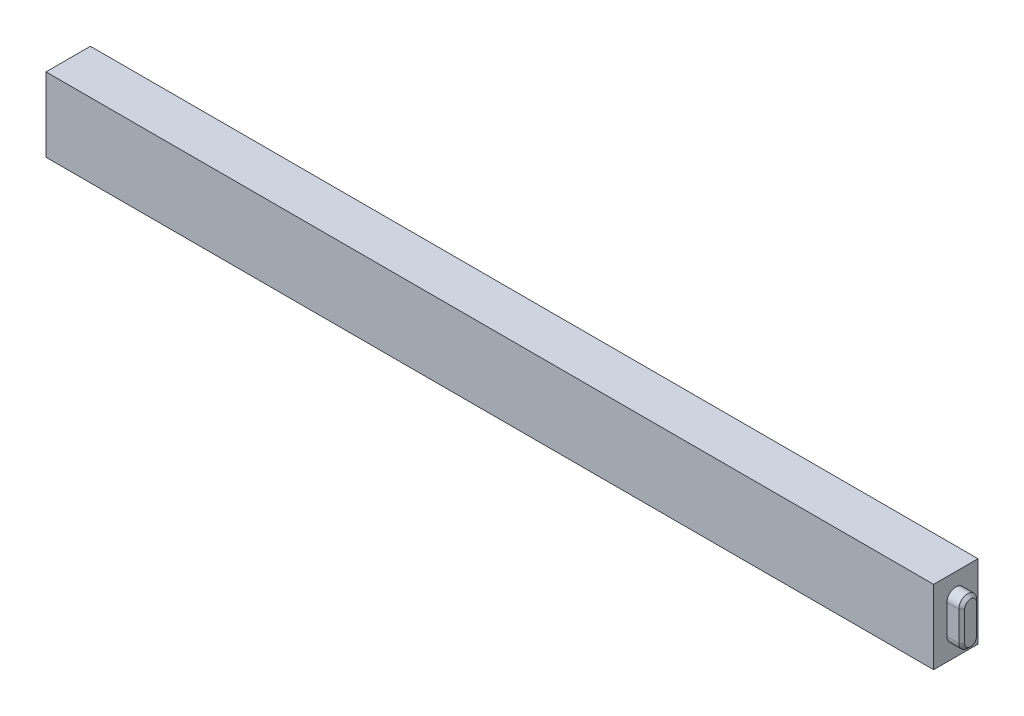
ISO-10303-21;
HEADER;
FILE_DESCRIPTION(('STEP AP214'),'2;1');
FILE_NAME('part.step','',(''),(''),'','','');
FILE_SCHEMA(('AUTOMOTIVE_DESIGN { 1 0 10303 214 1 1 1 1 }'));
ENDSEC;
DATA;
#1=APPLICATION_CONTEXT('core data for automotive mechanical design processes');
#2=APPLICATION_PROTOCOL_DEFINITION('international standard','automotive_design',2000,#1);
#3=PRODUCT_CONTEXT('',#1,'mechanical');
#4=PRODUCT('Part','Part','',(#3));
#5=PRODUCT_RELATED_PRODUCT_CATEGORY('part','',(#4));
#6=PRODUCT_DEFINITION_FORMATION('','',#4);
#7=PRODUCT_DEFINITION_CONTEXT('part definition',#1,'design');
#8=PRODUCT_DEFINITION('design','',#6,#7);
#9=PRODUCT_DEFINITION_SHAPE('','',#8);
#10=(LENGTH_UNIT() NAMED_UNIT(*) SI_UNIT(.MILLI.,.METRE.));
#11=(NAMED_UNIT(*) PLANE_ANGLE_UNIT() SI_UNIT($,.RADIAN.));
#12=(NAMED_UNIT(*) SI_UNIT($,.STERADIAN.) SOLID_ANGLE_UNIT());
#13=UNCERTAINTY_MEASURE_WITH_UNIT(LENGTH_MEASURE(1.E-05),#10,'distance_accuracy_value','');
#14=(GEOMETRIC_REPRESENTATION_CONTEXT(3) GLOBAL_UNCERTAINTY_ASSIGNED_CONTEXT((#13)) GLOBAL_UNIT_ASSIGNED_CONTEXT((#10,
#11,#12)) REPRESENTATION_CONTEXT('',''));
#15=CARTESIAN_POINT('',(0.,0.,0.));
#16=DIRECTION('',(0.,0.,1.));
#17=DIRECTION('',(1.,0.,0.));
#18=AXIS2_PLACEMENT_3D('',#15,#16,#17);
#19=CARTESIAN_POINT('',(-300.,25.,30.));
#20=DIRECTION('',(1.,0.,0.));
#21=DIRECTION('',(0.,1.,0.));
#22=AXIS2_PLACEMENT_3D('',#19,#20,#21);
#23=PLANE('',#22);
#24=DIRECTION('',(0.,-1.,0.));
#25=VECTOR('',#24,1.);
#26=CARTESIAN_POINT('',(-300.,25.,0.));
#27=LINE('',#26,#25);
#28=CARTESIAN_POINT('',(-300.,25.,0.));
#29=VERTEX_POINT('',#28);
#30=CARTESIAN_POINT('',(-300.,-25.,0.));
#31=VERTEX_POINT('',#30);
#32=EDGE_CURVE('E219',#29,#31,#27,.T.);
#33=ORIENTED_EDGE('',*,*,#32,.T.);
#34=DIRECTION('',(0.,0.,-1.));
#35=VECTOR('',#34,1.);
#36=CARTESIAN_POINT('',(-300.,-25.,30.));
#37=LINE('',#36,#35);
#38=CARTESIAN_POINT('',(-300.,-25.,30.));
#39=VERTEX_POINT('',#38);
#40=EDGE_CURVE('E224',#39,#31,#37,.T.);
#41=ORIENTED_EDGE('',*,*,#40,.F.);
#42=DIRECTION('',(0.,-1.,0.));
#43=VECTOR('',#42,1.);
#44=CARTESIAN_POINT('',(-300.,25.,30.));
#45=LINE('',#44,#43);
#46=CARTESIAN_POINT('',(-300.,25.,30.));
#47=VERTEX_POINT('',#46);
#48=EDGE_CURVE('E210',#47,#39,#45,.T.);
#49=ORIENTED_EDGE('',*,*,#48,.F.);
#50=DIRECTION('',(0.,0.,-1.));
#51=VECTOR('',#50,1.);
#52=CARTESIAN_POINT('',(-300.,25.,30.));
#53=LINE('',#52,#51);
#54=EDGE_CURVE('E227',#47,#29,#53,.T.);
#55=ORIENTED_EDGE('',*,*,#54,.T.);
#56=EDGE_LOOP('',(#33,#41,#49,#55));
#57=FACE_BOUND('',#56,.T.);
#58=CARTESIAN_POINT('',(-300.,10.,15.));
#59=DIRECTION('',(-1.,0.,0.));
#60=DIRECTION('',(0.,-1.,0.));
#61=AXIS2_PLACEMENT_3D('',#58,#59,#60);
#62=CIRCLE('',#61,6.);
#63=CARTESIAN_POINT('',(-300.,10.,21.));
#64=VERTEX_POINT('',#63);
#65=CARTESIAN_POINT('',(-300.,10.,9.));
#66=VERTEX_POINT('',#65);
#67=EDGE_CURVE('E172',#64,#66,#62,.T.);
#68=ORIENTED_EDGE('',*,*,#67,.F.);
#69=DIRECTION('',(0.,-1.,0.));
#70=VECTOR('',#69,1.);
#71=CARTESIAN_POINT('',(-300.,10.,21.));
#72=LINE('',#71,#70);
#73=CARTESIAN_POINT('',(-300.,-9.99999999999999,21.));
#74=VERTEX_POINT('',#73);
#75=EDGE_CURVE('E169',#64,#74,#72,.T.);
#76=ORIENTED_EDGE('',*,*,#75,.T.);
#77=CARTESIAN_POINT('',(-300.,-9.99999999999999,15.));
#78=DIRECTION('',(-1.,0.,0.));
#79=DIRECTION('',(0.,-1.,0.));
#80=AXIS2_PLACEMENT_3D('',#77,#78,#79);
#81=CIRCLE('',#80,6.);
#82=CARTESIAN_POINT('',(-300.,-9.99999999999999,9.00000000000001));
#83=VERTEX_POINT('',#82);
#84=EDGE_CURVE('E157',#83,#74,#81,.T.);
#85=ORIENTED_EDGE('',*,*,#84,.F.);
#86=DIRECTION('',(0.,-1.,0.));
#87=VECTOR('',#86,1.);
#88=CARTESIAN_POINT('',(-300.,10.,9.));
#89=LINE('',#88,#87);
#90=EDGE_CURVE('E166',#66,#83,#89,.T.);
#91=ORIENTED_EDGE('',*,*,#90,.F.);
#92=EDGE_LOOP('',(#68,#76,#85,#91));
#93=FACE_BOUND('',#92,.T.);
#94=ADVANCED_FACE('F41',(#57,#93),#23,.F.);
#95=CARTESIAN_POINT('',(300.,25.,30.));
#96=DIRECTION('',(-1.,0.,0.));
#97=DIRECTION('',(0.,0.,1.));
#98=AXIS2_PLACEMENT_3D('',#95,#96,#97);
#99=PLANE('',#98);
#100=DIRECTION('',(0.,1.,0.));
#101=VECTOR('',#100,1.);
#102=CARTESIAN_POINT('',(300.,25.,0.));
#103=LINE('',#102,#101);
#104=CARTESIAN_POINT('',(300.,-25.,0.));
#105=VERTEX_POINT('',#104);
#106=CARTESIAN_POINT('',(300.,25.,0.));
#107=VERTEX_POINT('',#106);
#108=EDGE_CURVE('E203',#105,#107,#103,.T.);
#109=ORIENTED_EDGE('',*,*,#108,.T.);
#110=DIRECTION('',(0.,0.,-1.));
#111=VECTOR('',#110,1.);
#112=CARTESIAN_POINT('',(300.,25.,30.));
#113=LINE('',#112,#111);
#114=CARTESIAN_POINT('',(300.,25.,30.));
#115=VERTEX_POINT('',#114);
#116=EDGE_CURVE('E230',#115,#107,#113,.T.);
#117=ORIENTED_EDGE('',*,*,#116,.F.);
#118=DIRECTION('',(0.,1.,0.));
#119=VECTOR('',#118,1.);
#120=CARTESIAN_POINT('',(300.,25.,30.));
#121=LINE('',#120,#119);
#122=CARTESIAN_POINT('',(300.,-25.,30.));
#123=VERTEX_POINT('',#122);
#124=EDGE_CURVE('E204',#123,#115,#121,.T.);
#125=ORIENTED_EDGE('',*,*,#124,.F.);
#126=DIRECTION('',(0.,0.,-1.));
#127=VECTOR('',#126,1.);
#128=CARTESIAN_POINT('',(300.,-25.,30.));
#129=LINE('',#128,#127);
#130=EDGE_CURVE('E214',#123,#105,#129,.T.);
#131=ORIENTED_EDGE('',*,*,#130,.T.);
#132=EDGE_LOOP('',(#109,#117,#125,#131));
#133=FACE_BOUND('',#132,.T.);
#134=CARTESIAN_POINT('',(300.,10.,15.));
#135=DIRECTION('',(1.,0.,0.));
#136=DIRECTION('',(0.,0.,-1.));
#137=AXIS2_PLACEMENT_3D('',#134,#135,#136);
#138=CIRCLE('',#137,6.);
#139=CARTESIAN_POINT('',(300.,10.,9.00000000000001));
#140=VERTEX_POINT('',#139);
#141=CARTESIAN_POINT('',(300.,10.,21.));
#142=VERTEX_POINT('',#141);
#143=EDGE_CURVE('E182',#140,#142,#138,.T.);
#144=ORIENTED_EDGE('',*,*,#143,.F.);
#145=DIRECTION('',(0.,1.,0.));
#146=VECTOR('',#145,1.);
#147=CARTESIAN_POINT('',(300.,10.,9.00000000000001));
#148=LINE('',#147,#146);
#149=CARTESIAN_POINT('',(300.,-9.99999999999999,9.));
#150=VERTEX_POINT('',#149);
#151=EDGE_CURVE('E192',#150,#140,#148,.T.);
#152=ORIENTED_EDGE('',*,*,#151,.F.);
#153=CARTESIAN_POINT('',(300.,-9.99999999999999,15.));
#154=DIRECTION('',(1.,0.,0.));
#155=DIRECTION('',(0.,0.,-1.));
#156=AXIS2_PLACEMENT_3D('',#153,#154,#155);
#157=CIRCLE('',#156,6.);
#158=CARTESIAN_POINT('',(300.,-9.99999999999999,21.));
#159=VERTEX_POINT('',#158);
#160=EDGE_CURVE('E189',#159,#150,#157,.T.);
#161=ORIENTED_EDGE('',*,*,#160,.F.);
#162=DIRECTION('',(0.,-1.,0.));
#163=VECTOR('',#162,1.);
#164=CARTESIAN_POINT('',(300.,10.,21.));
#165=LINE('',#164,#163);
#166=EDGE_CURVE('E185',#142,#159,#165,.T.);
#167=ORIENTED_EDGE('',*,*,#166,.F.);
#168=EDGE_LOOP('',(#144,#152,#161,#167));
#169=FACE_BOUND('',#168,.T.);
#170=ADVANCED_FACE('F316',(#133,#169),#99,.F.);
#171=CARTESIAN_POINT('',(-300.,25.,30.));
#172=DIRECTION('',(0.,-1.,0.));
#173=DIRECTION('',(0.,0.,-1.));
#174=AXIS2_PLACEMENT_3D('',#171,#172,#173);
#175=PLANE('',#174);
#176=DIRECTION('',(-1.,0.,0.));
#177=VECTOR('',#176,1.);
#178=CARTESIAN_POINT('',(-300.,25.,0.));
#179=LINE('',#178,#177);
#180=EDGE_CURVE('E217',#107,#29,#179,.T.);
#181=ORIENTED_EDGE('',*,*,#180,.T.);
#182=ORIENTED_EDGE('',*,*,#54,.F.);
#183=DIRECTION('',(-1.,0.,0.));
#184=VECTOR('',#183,1.);
#185=CARTESIAN_POINT('',(-300.,25.,30.));
#186=LINE('',#185,#184);
#187=EDGE_CURVE('E207',#115,#47,#186,.T.);
#188=ORIENTED_EDGE('',*,*,#187,.F.);
#189=ORIENTED_EDGE('',*,*,#116,.T.);
#190=EDGE_LOOP('',(#181,#182,#188,#189));
#191=FACE_BOUND('',#190,.T.);
#192=ADVANCED_FACE('F322',(#191),#175,.F.);
#193=CARTESIAN_POINT('',(-300.,-25.,30.));
#194=DIRECTION('',(0.,1.,0.));
#195=DIRECTION('',(0.,0.,1.));
#196=AXIS2_PLACEMENT_3D('',#193,#194,#195);
#197=PLANE('',#196);
#198=DIRECTION('',(1.,0.,0.));
#199=VECTOR('',#198,1.);
#200=CARTESIAN_POINT('',(-300.,-25.,0.));
#201=LINE('',#200,#199);
#202=EDGE_CURVE('E208',#31,#105,#201,.T.);
#203=ORIENTED_EDGE('',*,*,#202,.T.);
#204=ORIENTED_EDGE('',*,*,#130,.F.);
#205=DIRECTION('',(1.,0.,0.));
#206=VECTOR('',#205,1.);
#207=CARTESIAN_POINT('',(-300.,-25.,30.));
#208=LINE('',#207,#206);
#209=EDGE_CURVE('E212',#39,#123,#208,.T.);
#210=ORIENTED_EDGE('',*,*,#209,.F.);
#211=ORIENTED_EDGE('',*,*,#40,.T.);
#212=EDGE_LOOP('',(#203,#204,#210,#211));
#213=FACE_BOUND('',#212,.T.);
#214=ADVANCED_FACE('F327',(#213),#197,.F.);
#215=CARTESIAN_POINT('',(0.,0.,30.));
#216=DIRECTION('',(0.,0.,1.));
#217=DIRECTION('',(1.,0.,0.));
#218=AXIS2_PLACEMENT_3D('',#215,#216,#217);
#219=PLANE('',#218);
#220=ORIENTED_EDGE('',*,*,#124,.T.);
#221=ORIENTED_EDGE('',*,*,#187,.T.);
#222=ORIENTED_EDGE('',*,*,#48,.T.);
#223=ORIENTED_EDGE('',*,*,#209,.T.);
#224=EDGE_LOOP('',(#220,#221,#222,#223));
#225=FACE_BOUND('',#224,.T.);
#226=ADVANCED_FACE('F476',(#225),#219,.T.);
#227=CARTESIAN_POINT('',(0.,0.,0.));
#228=DIRECTION('',(0.,0.,1.));
#229=DIRECTION('',(1.,0.,0.));
#230=AXIS2_PLACEMENT_3D('',#227,#228,#229);
#231=PLANE('',#230);
#232=ORIENTED_EDGE('',*,*,#108,.F.);
#233=ORIENTED_EDGE('',*,*,#202,.F.);
#234=ORIENTED_EDGE('',*,*,#32,.F.);
#235=ORIENTED_EDGE('',*,*,#180,.F.);
#236=EDGE_LOOP('',(#232,#233,#234,#235));
#237=FACE_BOUND('',#236,.T.);
#238=ADVANCED_FACE('F464',(#237),#231,.F.);
#239=CARTESIAN_POINT('',(310.,10.,15.));
#240=DIRECTION('',(-1.,0.,0.));
#241=DIRECTION('',(0.,0.,1.));
#242=AXIS2_PLACEMENT_3D('',#239,#240,#241);
#243=CYLINDRICAL_SURFACE('',#242,6.);
#244=DIRECTION('',(-1.,0.,0.));
#245=VECTOR('',#244,1.);
#246=CARTESIAN_POINT('',(310.,10.,21.));
#247=LINE('',#246,#245);
#248=CARTESIAN_POINT('',(308.,10.,21.));
#249=VERTEX_POINT('',#248);
#250=EDGE_CURVE('E201',#249,#142,#247,.T.);
#251=ORIENTED_EDGE('',*,*,#250,.F.);
#252=CARTESIAN_POINT('',(308.,10.,15.));
#253=DIRECTION('',(1.,0.,0.));
#254=DIRECTION('',(0.,0.,-1.));
#255=AXIS2_PLACEMENT_3D('',#252,#253,#254);
#256=CIRCLE('',#255,6.);
#257=CARTESIAN_POINT('',(308.,10.,9.00000000000001));
#258=VERTEX_POINT('',#257);
#259=EDGE_CURVE('E249',#249,#258,#256,.F.);
#260=ORIENTED_EDGE('',*,*,#259,.T.);
#261=DIRECTION('',(-1.,0.,0.));
#262=VECTOR('',#261,1.);
#263=CARTESIAN_POINT('',(310.,10.,9.00000000000001));
#264=LINE('',#263,#262);
#265=EDGE_CURVE('E195',#258,#140,#264,.T.);
#266=ORIENTED_EDGE('',*,*,#265,.T.);
#267=ORIENTED_EDGE('',*,*,#143,.T.);
#268=EDGE_LOOP('',(#251,#260,#266,#267));
#269=FACE_BOUND('',#268,.T.);
#270=ADVANCED_FACE('F456',(#269),#243,.T.);
#271=CARTESIAN_POINT('',(310.,10.,21.));
#272=DIRECTION('',(0.,0.,-1.));
#273=DIRECTION('',(0.,1.,0.));
#274=AXIS2_PLACEMENT_3D('',#271,#272,#273);
#275=PLANE('',#274);
#276=DIRECTION('',(-1.,0.,0.));
#277=VECTOR('',#276,1.);
#278=CARTESIAN_POINT('',(310.,-9.99999999999999,21.));
#279=LINE('',#278,#277);
#280=CARTESIAN_POINT('',(308.,-9.99999999999999,21.));
#281=VERTEX_POINT('',#280);
#282=EDGE_CURVE('E199',#281,#159,#279,.T.);
#283=ORIENTED_EDGE('',*,*,#282,.F.);
#284=DIRECTION('',(0.,1.,0.));
#285=VECTOR('',#284,1.);
#286=CARTESIAN_POINT('',(308.,10.,21.));
#287=LINE('',#286,#285);
#288=EDGE_CURVE('E247',#281,#249,#287,.T.);
#289=ORIENTED_EDGE('',*,*,#288,.T.);
#290=ORIENTED_EDGE('',*,*,#250,.T.);
#291=ORIENTED_EDGE('',*,*,#166,.T.);
#292=EDGE_LOOP('',(#283,#289,#290,#291));
#293=FACE_BOUND('',#292,.T.);
#294=ADVANCED_FACE('F448',(#293),#275,.F.);
#295=CARTESIAN_POINT('',(310.,-9.99999999999999,15.));
#296=DIRECTION('',(-1.,0.,0.));
#297=DIRECTION('',(0.,0.,1.));
#298=AXIS2_PLACEMENT_3D('',#295,#296,#297);
#299=CYLINDRICAL_SURFACE('',#298,6.);
#300=DIRECTION('',(-1.,0.,0.));
#301=VECTOR('',#300,1.);
#302=CARTESIAN_POINT('',(310.,-9.99999999999999,9.));
#303=LINE('',#302,#301);
#304=CARTESIAN_POINT('',(308.,-9.99999999999999,9.));
#305=VERTEX_POINT('',#304);
#306=EDGE_CURVE('E197',#305,#150,#303,.T.);
#307=ORIENTED_EDGE('',*,*,#306,.F.);
#308=CARTESIAN_POINT('',(308.,-9.99999999999999,15.));
#309=DIRECTION('',(1.,0.,0.));
#310=DIRECTION('',(0.,0.,-1.));
#311=AXIS2_PLACEMENT_3D('',#308,#309,#310);
#312=CIRCLE('',#311,6.);
#313=EDGE_CURVE('E245',#305,#281,#312,.F.);
#314=ORIENTED_EDGE('',*,*,#313,.T.);
#315=ORIENTED_EDGE('',*,*,#282,.T.);
#316=ORIENTED_EDGE('',*,*,#160,.T.);
#317=EDGE_LOOP('',(#307,#314,#315,#316));
#318=FACE_BOUND('',#317,.T.);
#319=ADVANCED_FACE('F440',(#318),#299,.T.);
#320=CARTESIAN_POINT('',(310.,10.,9.00000000000001));
#321=DIRECTION('',(0.,0.,1.));
#322=DIRECTION('',(0.,-1.,0.));
#323=AXIS2_PLACEMENT_3D('',#320,#321,#322);
#324=PLANE('',#323);
#325=ORIENTED_EDGE('',*,*,#265,.F.);
#326=DIRECTION('',(0.,-1.,0.));
#327=VECTOR('',#326,1.);
#328=CARTESIAN_POINT('',(308.,-9.99999999999999,9.));
#329=LINE('',#328,#327);
#330=EDGE_CURVE('E242',#258,#305,#329,.T.);
#331=ORIENTED_EDGE('',*,*,#330,.T.);
#332=ORIENTED_EDGE('',*,*,#306,.T.);
#333=ORIENTED_EDGE('',*,*,#151,.T.);
#334=EDGE_LOOP('',(#325,#331,#332,#333));
#335=FACE_BOUND('',#334,.T.);
#336=ADVANCED_FACE('F433',(#335),#324,.F.);
#337=CARTESIAN_POINT('',(310.,10.,15.));
#338=DIRECTION('',(1.,0.,0.));
#339=DIRECTION('',(0.,0.,-1.));
#340=AXIS2_PLACEMENT_3D('',#337,#338,#339);
#341=PLANE('',#340);
#342=CARTESIAN_POINT('',(310.,-9.99999999999999,15.));
#343=DIRECTION('',(1.,0.,0.));
#344=DIRECTION('',(0.,0.,-1.));
#345=AXIS2_PLACEMENT_3D('',#342,#343,#344);
#346=CIRCLE('',#345,4.00000000000006);
#347=CARTESIAN_POINT('',(310.,-9.99999999999999,19.0000000000001));
#348=VERTEX_POINT('',#347);
#349=CARTESIAN_POINT('',(310.,-9.99999999999999,10.9999999999999));
#350=VERTEX_POINT('',#349);
#351=EDGE_CURVE('E237',#348,#350,#346,.T.);
#352=ORIENTED_EDGE('',*,*,#351,.T.);
#353=DIRECTION('',(0.,1.,0.));
#354=VECTOR('',#353,1.);
#355=CARTESIAN_POINT('',(310.,10.,10.9999999999999));
#356=LINE('',#355,#354);
#357=CARTESIAN_POINT('',(310.,10.,10.9999999999999));
#358=VERTEX_POINT('',#357);
#359=EDGE_CURVE('E239',#350,#358,#356,.T.);
#360=ORIENTED_EDGE('',*,*,#359,.T.);
#361=CARTESIAN_POINT('',(310.,10.,15.));
#362=DIRECTION('',(1.,0.,0.));
#363=DIRECTION('',(0.,0.,-1.));
#364=AXIS2_PLACEMENT_3D('',#361,#362,#363);
#365=CIRCLE('',#364,4.00000000000006);
#366=CARTESIAN_POINT('',(310.,10.,19.0000000000001));
#367=VERTEX_POINT('',#366);
#368=EDGE_CURVE('E233',#358,#367,#365,.T.);
#369=ORIENTED_EDGE('',*,*,#368,.T.);
#370=DIRECTION('',(0.,-1.,0.));
#371=VECTOR('',#370,1.);
#372=CARTESIAN_POINT('',(310.,-9.99999999999999,19.0000000000001));
#373=LINE('',#372,#371);
#374=EDGE_CURVE('E235',#367,#348,#373,.T.);
#375=ORIENTED_EDGE('',*,*,#374,.T.);
#376=EDGE_LOOP('',(#352,#360,#369,#375));
#377=FACE_BOUND('',#376,.T.);
#378=ADVANCED_FACE('F354',(#377),#341,.T.);
#379=CARTESIAN_POINT('',(310.,10.,19.0000000000001));
#380=DIRECTION('',(0.707106781186546,0.,0.707106781186549));
#381=DIRECTION('',(0.,1.,0.));
#382=AXIS2_PLACEMENT_3D('',#379,#380,#381);
#383=PLANE('',#382);
#384=DIRECTION('',(0.707106781186549,0.,-0.707106781186546));
#385=VECTOR('',#384,1.);
#386=CARTESIAN_POINT('',(308.,10.,21.));
#387=LINE('',#386,#385);
#388=EDGE_CURVE('E255',#249,#367,#387,.T.);
#389=ORIENTED_EDGE('',*,*,#388,.F.);
#390=ORIENTED_EDGE('',*,*,#288,.F.);
#391=DIRECTION('',(-0.707106781186549,0.,0.707106781186546));
#392=VECTOR('',#391,1.);
#393=CARTESIAN_POINT('',(310.,-9.99999999999999,19.0000000000001));
#394=LINE('',#393,#392);
#395=EDGE_CURVE('E186',#348,#281,#394,.T.);
#396=ORIENTED_EDGE('',*,*,#395,.F.);
#397=ORIENTED_EDGE('',*,*,#374,.F.);
#398=EDGE_LOOP('',(#389,#390,#396,#397));
#399=FACE_BOUND('',#398,.T.);
#400=ADVANCED_FACE('F348',(#399),#383,.T.);
#401=CARTESIAN_POINT('',(310.,-9.99999999999999,15.));
#402=DIRECTION('',(-1.,0.,0.));
#403=DIRECTION('',(0.,0.,1.));
#404=AXIS2_PLACEMENT_3D('',#401,#402,#403);
#405=CONICAL_SURFACE('',#404,4.00000000000006,0.785398163397446);
#406=ORIENTED_EDGE('',*,*,#395,.T.);
#407=ORIENTED_EDGE('',*,*,#313,.F.);
#408=DIRECTION('',(-0.707106781186549,0.,-0.707106781186546));
#409=VECTOR('',#408,1.);
#410=CARTESIAN_POINT('',(310.,-9.99999999999999,10.9999999999999));
#411=LINE('',#410,#409);
#412=EDGE_CURVE('E253',#350,#305,#411,.T.);
#413=ORIENTED_EDGE('',*,*,#412,.F.);
#414=ORIENTED_EDGE('',*,*,#351,.F.);
#415=EDGE_LOOP('',(#406,#407,#413,#414));
#416=FACE_BOUND('',#415,.T.);
#417=ADVANCED_FACE('F341',(#416),#405,.T.);
#418=CARTESIAN_POINT('',(310.,10.,15.));
#419=DIRECTION('',(-1.,0.,0.));
#420=DIRECTION('',(0.,0.,1.));
#421=AXIS2_PLACEMENT_3D('',#418,#419,#420);
#422=CONICAL_SURFACE('',#421,4.00000000000006,0.785398163397447);
#423=ORIENTED_EDGE('',*,*,#388,.T.);
#424=ORIENTED_EDGE('',*,*,#368,.F.);
#425=DIRECTION('',(0.707106781186548,0.,0.707106781186547));
#426=VECTOR('',#425,1.);
#427=CARTESIAN_POINT('',(308.,10.,9.00000000000001));
#428=LINE('',#427,#426);
#429=EDGE_CURVE('E181',#258,#358,#428,.T.);
#430=ORIENTED_EDGE('',*,*,#429,.F.);
#431=ORIENTED_EDGE('',*,*,#259,.F.);
#432=EDGE_LOOP('',(#423,#424,#430,#431));
#433=FACE_BOUND('',#432,.T.);
#434=ADVANCED_FACE('F312',(#433),#422,.T.);
#435=CARTESIAN_POINT('',(310.,10.,10.9999999999999));
#436=DIRECTION('',(0.707106781186546,0.,-0.707106781186549));
#437=DIRECTION('',(0.,-1.,0.));
#438=AXIS2_PLACEMENT_3D('',#435,#436,#437);
#439=PLANE('',#438);
#440=ORIENTED_EDGE('',*,*,#412,.T.);
#441=ORIENTED_EDGE('',*,*,#330,.F.);
#442=ORIENTED_EDGE('',*,*,#429,.T.);
#443=ORIENTED_EDGE('',*,*,#359,.F.);
#444=EDGE_LOOP('',(#440,#441,#442,#443));
#445=FACE_BOUND('',#444,.T.);
#446=ADVANCED_FACE('F304',(#445),#439,.T.);
#447=CARTESIAN_POINT('',(-310.,10.,15.));
#448=DIRECTION('',(1.,0.,0.));
#449=DIRECTION('',(0.,1.,0.));
#450=AXIS2_PLACEMENT_3D('',#447,#448,#449);
#451=CYLINDRICAL_SURFACE('',#450,6.);
#452=DIRECTION('',(1.,0.,0.));
#453=VECTOR('',#452,1.);
#454=CARTESIAN_POINT('',(-310.,10.,9.));
#455=LINE('',#454,#453);
#456=CARTESIAN_POINT('',(-308.,10.,9.));
#457=VERTEX_POINT('',#456);
#458=EDGE_CURVE('E159',#457,#66,#455,.T.);
#459=ORIENTED_EDGE('',*,*,#458,.F.);
#460=CARTESIAN_POINT('',(-308.,10.,15.));
#461=DIRECTION('',(-1.,0.,0.));
#462=DIRECTION('',(0.,-1.,0.));
#463=AXIS2_PLACEMENT_3D('',#460,#461,#462);
#464=CIRCLE('',#463,6.);
#465=CARTESIAN_POINT('',(-308.,10.,21.));
#466=VERTEX_POINT('',#465);
#467=EDGE_CURVE('E11',#457,#466,#464,.F.);
#468=ORIENTED_EDGE('',*,*,#467,.T.);
#469=DIRECTION('',(1.,0.,0.));
#470=VECTOR('',#469,1.);
#471=CARTESIAN_POINT('',(-310.,10.,21.));
#472=LINE('',#471,#470);
#473=EDGE_CURVE('E177',#466,#64,#472,.T.);
#474=ORIENTED_EDGE('',*,*,#473,.T.);
#475=ORIENTED_EDGE('',*,*,#67,.T.);
#476=EDGE_LOOP('',(#459,#468,#474,#475));
#477=FACE_BOUND('',#476,.T.);
#478=ADVANCED_FACE('F302',(#477),#451,.T.);
#479=CARTESIAN_POINT('',(-310.,10.,9.));
#480=DIRECTION('',(0.,0.,1.));
#481=DIRECTION('',(0.,-1.,0.));
#482=AXIS2_PLACEMENT_3D('',#479,#480,#481);
#483=PLANE('',#482);
#484=DIRECTION('',(1.,0.,0.));
#485=VECTOR('',#484,1.);
#486=CARTESIAN_POINT('',(-310.,-9.99999999999998,9.00000000000001));
#487=LINE('',#486,#485);
#488=CARTESIAN_POINT('',(-308.,-9.99999999999999,9.00000000000001));
#489=VERTEX_POINT('',#488);
#490=EDGE_CURVE('E154',#489,#83,#487,.T.);
#491=ORIENTED_EDGE('',*,*,#490,.F.);
#492=DIRECTION('',(0.,1.,0.));
#493=VECTOR('',#492,1.);
#494=CARTESIAN_POINT('',(-308.,10.,9.));
#495=LINE('',#494,#493);
#496=EDGE_CURVE('E51',#489,#457,#495,.T.);
#497=ORIENTED_EDGE('',*,*,#496,.T.);
#498=ORIENTED_EDGE('',*,*,#458,.T.);
#499=ORIENTED_EDGE('',*,*,#90,.T.);
#500=EDGE_LOOP('',(#491,#497,#498,#499));
#501=FACE_BOUND('',#500,.T.);
#502=ADVANCED_FACE('F171',(#501),#483,.F.);
#503=CARTESIAN_POINT('',(-310.,-9.99999999999998,15.));
#504=DIRECTION('',(1.,0.,0.));
#505=DIRECTION('',(0.,1.,0.));
#506=AXIS2_PLACEMENT_3D('',#503,#504,#505);
#507=CYLINDRICAL_SURFACE('',#506,6.);
#508=DIRECTION('',(1.,0.,0.));
#509=VECTOR('',#508,1.);
#510=CARTESIAN_POINT('',(-310.,-9.99999999999998,21.));
#511=LINE('',#510,#509);
#512=CARTESIAN_POINT('',(-308.,-9.99999999999998,21.));
#513=VERTEX_POINT('',#512);
#514=EDGE_CURVE('E160',#513,#74,#511,.T.);
#515=ORIENTED_EDGE('',*,*,#514,.F.);
#516=CARTESIAN_POINT('',(-308.,-9.99999999999998,15.));
#517=DIRECTION('',(-1.,0.,0.));
#518=DIRECTION('',(0.,-1.,0.));
#519=AXIS2_PLACEMENT_3D('',#516,#517,#518);
#520=CIRCLE('',#519,6.);
#521=EDGE_CURVE('E66',#513,#489,#520,.F.);
#522=ORIENTED_EDGE('',*,*,#521,.T.);
#523=ORIENTED_EDGE('',*,*,#490,.T.);
#524=ORIENTED_EDGE('',*,*,#84,.T.);
#525=EDGE_LOOP('',(#515,#522,#523,#524));
#526=FACE_BOUND('',#525,.T.);
#527=ADVANCED_FACE('F156',(#526),#507,.T.);
#528=CARTESIAN_POINT('',(-310.,10.,21.));
#529=DIRECTION('',(0.,0.,1.));
#530=DIRECTION('',(0.,-1.,0.));
#531=AXIS2_PLACEMENT_3D('',#528,#529,#530);
#532=PLANE('',#531);
#533=ORIENTED_EDGE('',*,*,#473,.F.);
#534=DIRECTION('',(0.,-1.,0.));
#535=VECTOR('',#534,1.);
#536=CARTESIAN_POINT('',(-308.,10.,21.));
#537=LINE('',#536,#535);
#538=EDGE_CURVE('E251',#466,#513,#537,.T.);
#539=ORIENTED_EDGE('',*,*,#538,.T.);
#540=ORIENTED_EDGE('',*,*,#514,.T.);
#541=ORIENTED_EDGE('',*,*,#75,.F.);
#542=EDGE_LOOP('',(#533,#539,#540,#541));
#543=FACE_BOUND('',#542,.T.);
#544=ADVANCED_FACE('F300',(#543),#532,.T.);
#545=CARTESIAN_POINT('',(-310.,10.,15.));
#546=DIRECTION('',(-1.,0.,0.));
#547=DIRECTION('',(0.,-1.,0.));
#548=AXIS2_PLACEMENT_3D('',#545,#546,#547);
#549=PLANE('',#548);
#550=CARTESIAN_POINT('',(-310.,-9.99999999999998,15.));
#551=DIRECTION('',(-1.,0.,0.));
#552=DIRECTION('',(0.,-1.,0.));
#553=AXIS2_PLACEMENT_3D('',#550,#551,#552);
#554=CIRCLE('',#553,3.99999999999999);
#555=CARTESIAN_POINT('',(-310.,-9.99999999999998,11.));
#556=VERTEX_POINT('',#555);
#557=CARTESIAN_POINT('',(-310.,-9.99999999999998,19.));
#558=VERTEX_POINT('',#557);
#559=EDGE_CURVE('E266',#556,#558,#554,.T.);
#560=ORIENTED_EDGE('',*,*,#559,.T.);
#561=DIRECTION('',(0.,1.,0.));
#562=VECTOR('',#561,1.);
#563=CARTESIAN_POINT('',(-310.,10.,19.));
#564=LINE('',#563,#562);
#565=CARTESIAN_POINT('',(-310.,10.,19.));
#566=VERTEX_POINT('',#565);
#567=EDGE_CURVE('E268',#558,#566,#564,.T.);
#568=ORIENTED_EDGE('',*,*,#567,.T.);
#569=CARTESIAN_POINT('',(-310.,10.,15.));
#570=DIRECTION('',(-1.,0.,0.));
#571=DIRECTION('',(0.,-1.,0.));
#572=AXIS2_PLACEMENT_3D('',#569,#570,#571);
#573=CIRCLE('',#572,4.00000000000001);
#574=CARTESIAN_POINT('',(-310.,10.,11.));
#575=VERTEX_POINT('',#574);
#576=EDGE_CURVE('E262',#566,#575,#573,.T.);
#577=ORIENTED_EDGE('',*,*,#576,.T.);
#578=DIRECTION('',(0.,-1.,0.));
#579=VECTOR('',#578,1.);
#580=CARTESIAN_POINT('',(-310.,-9.99999999999998,11.));
#581=LINE('',#580,#579);
#582=EDGE_CURVE('E264',#575,#556,#581,.T.);
#583=ORIENTED_EDGE('',*,*,#582,.T.);
#584=EDGE_LOOP('',(#560,#568,#577,#583));
#585=FACE_BOUND('',#584,.T.);
#586=ADVANCED_FACE('F291',(#585),#549,.T.);
#587=CARTESIAN_POINT('',(-310.,10.,11.));
#588=DIRECTION('',(-0.707106781186555,0.,-0.70710678118654));
#589=DIRECTION('',(0.,1.,0.));
#590=AXIS2_PLACEMENT_3D('',#587,#588,#589);
#591=PLANE('',#590);
#592=DIRECTION('',(0.70710678118654,0.,-0.707106781186555));
#593=VECTOR('',#592,1.);
#594=CARTESIAN_POINT('',(-310.,-9.99999999999998,11.));
#595=LINE('',#594,#593);
#596=EDGE_CURVE('E276',#556,#489,#595,.T.);
#597=ORIENTED_EDGE('',*,*,#596,.F.);
#598=ORIENTED_EDGE('',*,*,#582,.F.);
#599=DIRECTION('',(-0.70710678118654,0.,0.707106781186555));
#600=VECTOR('',#599,1.);
#601=CARTESIAN_POINT('',(-308.,10.,9.));
#602=LINE('',#601,#600);
#603=EDGE_CURVE('E46',#457,#575,#602,.T.);
#604=ORIENTED_EDGE('',*,*,#603,.F.);
#605=ORIENTED_EDGE('',*,*,#496,.F.);
#606=EDGE_LOOP('',(#597,#598,#604,#605));
#607=FACE_BOUND('',#606,.T.);
#608=ADVANCED_FACE('F44',(#607),#591,.T.);
#609=CARTESIAN_POINT('',(-310.,10.,15.));
#610=DIRECTION('',(1.,0.,0.));
#611=DIRECTION('',(0.,1.,0.));
#612=AXIS2_PLACEMENT_3D('',#609,#610,#611);
#613=CONICAL_SURFACE('',#612,4.00000000000001,0.785398163397458);
#614=ORIENTED_EDGE('',*,*,#603,.T.);
#615=ORIENTED_EDGE('',*,*,#576,.F.);
#616=DIRECTION('',(-0.70710678118654,0.,-0.707106781186555));
#617=VECTOR('',#616,1.);
#618=CARTESIAN_POINT('',(-308.,10.,21.));
#619=LINE('',#618,#617);
#620=EDGE_CURVE('E275',#466,#566,#619,.T.);
#621=ORIENTED_EDGE('',*,*,#620,.F.);
#622=ORIENTED_EDGE('',*,*,#467,.F.);
#623=EDGE_LOOP('',(#614,#615,#621,#622));
#624=FACE_BOUND('',#623,.T.);
#625=ADVANCED_FACE('F286',(#624),#613,.T.);
#626=CARTESIAN_POINT('',(-310.,-9.99999999999998,15.));
#627=DIRECTION('',(1.,0.,0.));
#628=DIRECTION('',(0.,1.,0.));
#629=AXIS2_PLACEMENT_3D('',#626,#627,#628);
#630=CONICAL_SURFACE('',#629,4.00000000000001,0.785398163397458);
#631=ORIENTED_EDGE('',*,*,#596,.T.);
#632=ORIENTED_EDGE('',*,*,#521,.F.);
#633=DIRECTION('',(0.707106781186536,0.,0.707106781186559));
#634=VECTOR('',#633,1.);
#635=CARTESIAN_POINT('',(-310.,-9.99999999999998,19.));
#636=LINE('',#635,#634);
#637=EDGE_CURVE('E273',#558,#513,#636,.T.);
#638=ORIENTED_EDGE('',*,*,#637,.F.);
#639=ORIENTED_EDGE('',*,*,#559,.F.);
#640=EDGE_LOOP('',(#631,#632,#638,#639));
#641=FACE_BOUND('',#640,.T.);
#642=ADVANCED_FACE('F297',(#641),#630,.T.);
#643=CARTESIAN_POINT('',(-308.,10.,21.));
#644=DIRECTION('',(0.707106781186555,0.,-0.70710678118654));
#645=DIRECTION('',(0.,-1.,0.));
#646=AXIS2_PLACEMENT_3D('',#643,#644,#645);
#647=PLANE('',#646);
#648=ORIENTED_EDGE('',*,*,#620,.T.);
#649=ORIENTED_EDGE('',*,*,#567,.F.);
#650=ORIENTED_EDGE('',*,*,#637,.T.);
#651=ORIENTED_EDGE('',*,*,#538,.F.);
#652=EDGE_LOOP('',(#648,#649,#650,#651));
#653=FACE_BOUND('',#652,.T.);
#654=ADVANCED_FACE('F295',(#653),#647,.F.);
#655=CLOSED_SHELL('',(#94,#170,#192,#214,#226,#238,#270,#294,#319,#336,#378,#400,#417,#434,#446,
#478,#502,#527,#544,#586,#608,#625,#642,#654));
#656=MANIFOLD_SOLID_BREP('B2',#655);
#657=ADVANCED_BREP_SHAPE_REPRESENTATION('',(#18,#656),#14);
#658=SHAPE_DEFINITION_REPRESENTATION(#9,#657);
ENDSEC;
END-ISO-10303-21;
